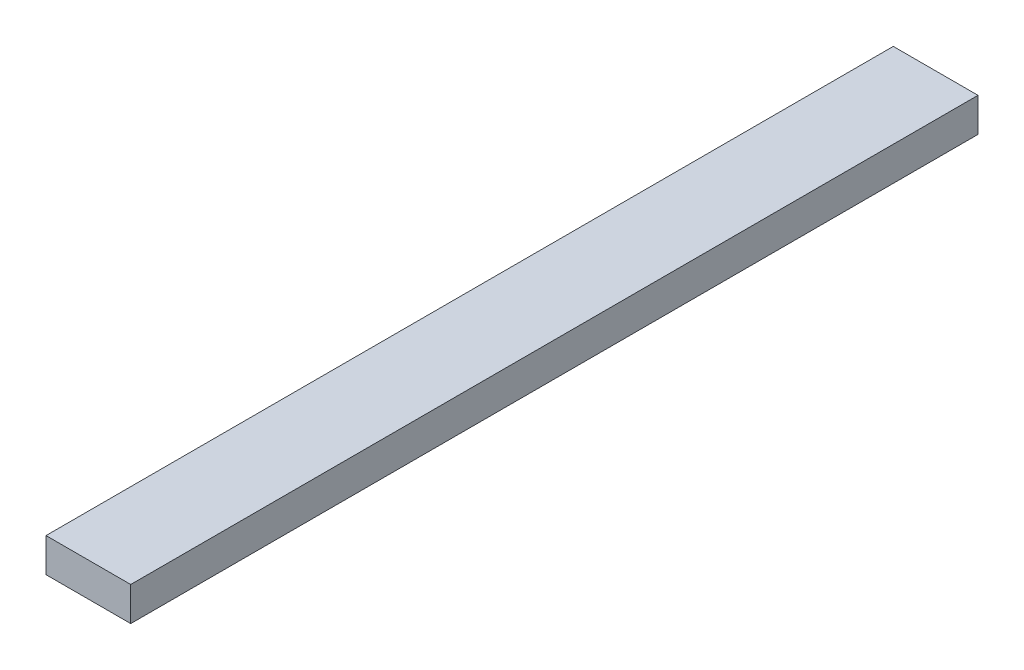
ISO-10303-21;
HEADER;
FILE_DESCRIPTION(('STEP AP214'),'2;1');
FILE_NAME('part.step','',(''),(''),'','','');
FILE_SCHEMA(('AUTOMOTIVE_DESIGN { 1 0 10303 214 1 1 1 1 }'));
ENDSEC;
DATA;
#1=APPLICATION_CONTEXT('core data for automotive mechanical design processes');
#2=APPLICATION_PROTOCOL_DEFINITION('international standard','automotive_design',2000,#1);
#3=PRODUCT_CONTEXT('',#1,'mechanical');
#4=PRODUCT('Part','Part','',(#3));
#5=PRODUCT_RELATED_PRODUCT_CATEGORY('part','',(#4));
#6=PRODUCT_DEFINITION_FORMATION('','',#4);
#7=PRODUCT_DEFINITION_CONTEXT('part definition',#1,'design');
#8=PRODUCT_DEFINITION('design','',#6,#7);
#9=PRODUCT_DEFINITION_SHAPE('','',#8);
#10=(LENGTH_UNIT() NAMED_UNIT(*) SI_UNIT(.MILLI.,.METRE.));
#11=(NAMED_UNIT(*) PLANE_ANGLE_UNIT() SI_UNIT($,.RADIAN.));
#12=(NAMED_UNIT(*) SI_UNIT($,.STERADIAN.) SOLID_ANGLE_UNIT());
#13=UNCERTAINTY_MEASURE_WITH_UNIT(LENGTH_MEASURE(1.E-05),#10,'distance_accuracy_value','');
#14=(GEOMETRIC_REPRESENTATION_CONTEXT(3) GLOBAL_UNCERTAINTY_ASSIGNED_CONTEXT((#13)) GLOBAL_UNIT_ASSIGNED_CONTEXT((#10,
#11,#12)) REPRESENTATION_CONTEXT('',''));
#15=CARTESIAN_POINT('',(0.,0.,0.));
#16=DIRECTION('',(0.,0.,1.));
#17=DIRECTION('',(1.,0.,0.));
#18=AXIS2_PLACEMENT_3D('',#15,#16,#17);
#19=CARTESIAN_POINT('',(25.,10.,500.));
#20=DIRECTION('',(-1.,0.,0.));
#21=DIRECTION('',(0.,0.,1.));
#22=AXIS2_PLACEMENT_3D('',#19,#20,#21);
#23=PLANE('',#22);
#24=DIRECTION('',(0.,1.,0.));
#25=VECTOR('',#24,1.);
#26=CARTESIAN_POINT('',(25.,10.,0.));
#27=LINE('',#26,#25);
#28=CARTESIAN_POINT('',(25.,-10.,0.));
#29=VERTEX_POINT('',#28);
#30=CARTESIAN_POINT('',(25.,10.,0.));
#31=VERTEX_POINT('',#30);
#32=EDGE_CURVE('E104',#29,#31,#27,.T.);
#33=ORIENTED_EDGE('',*,*,#32,.T.);
#34=DIRECTION('',(0.,0.,-1.));
#35=VECTOR('',#34,1.);
#36=CARTESIAN_POINT('',(25.,10.,500.));
#37=LINE('',#36,#35);
#38=CARTESIAN_POINT('',(25.,10.,500.));
#39=VERTEX_POINT('',#38);
#40=EDGE_CURVE('E11',#39,#31,#37,.T.);
#41=ORIENTED_EDGE('',*,*,#40,.F.);
#42=DIRECTION('',(0.,1.,0.));
#43=VECTOR('',#42,1.);
#44=CARTESIAN_POINT('',(25.,10.,500.));
#45=LINE('',#44,#43);
#46=CARTESIAN_POINT('',(25.,-10.,500.));
#47=VERTEX_POINT('',#46);
#48=EDGE_CURVE('E92',#47,#39,#45,.T.);
#49=ORIENTED_EDGE('',*,*,#48,.F.);
#50=DIRECTION('',(0.,0.,-1.));
#51=VECTOR('',#50,1.);
#52=CARTESIAN_POINT('',(25.,-10.,500.));
#53=LINE('',#52,#51);
#54=EDGE_CURVE('E100',#47,#29,#53,.T.);
#55=ORIENTED_EDGE('',*,*,#54,.T.);
#56=EDGE_LOOP('',(#33,#41,#49,#55));
#57=FACE_BOUND('',#56,.T.);
#58=ADVANCED_FACE('F41',(#57),#23,.F.);
#59=CARTESIAN_POINT('',(-25.,10.,500.));
#60=DIRECTION('',(0.,-1.,0.));
#61=DIRECTION('',(0.,0.,-1.));
#62=AXIS2_PLACEMENT_3D('',#59,#60,#61);
#63=PLANE('',#62);
#64=DIRECTION('',(-1.,0.,0.));
#65=VECTOR('',#64,1.);
#66=CARTESIAN_POINT('',(-25.,10.,0.));
#67=LINE('',#66,#65);
#68=CARTESIAN_POINT('',(-25.,10.,0.));
#69=VERTEX_POINT('',#68);
#70=EDGE_CURVE('E96',#31,#69,#67,.T.);
#71=ORIENTED_EDGE('',*,*,#70,.T.);
#72=DIRECTION('',(0.,0.,-1.));
#73=VECTOR('',#72,1.);
#74=CARTESIAN_POINT('',(-25.,10.,500.));
#75=LINE('',#74,#73);
#76=CARTESIAN_POINT('',(-25.,10.,500.));
#77=VERTEX_POINT('',#76);
#78=EDGE_CURVE('E49',#77,#69,#75,.T.);
#79=ORIENTED_EDGE('',*,*,#78,.F.);
#80=DIRECTION('',(-1.,0.,0.));
#81=VECTOR('',#80,1.);
#82=CARTESIAN_POINT('',(-25.,10.,500.));
#83=LINE('',#82,#81);
#84=EDGE_CURVE('E87',#39,#77,#83,.T.);
#85=ORIENTED_EDGE('',*,*,#84,.F.);
#86=ORIENTED_EDGE('',*,*,#40,.T.);
#87=EDGE_LOOP('',(#71,#79,#85,#86));
#88=FACE_BOUND('',#87,.T.);
#89=ADVANCED_FACE('F95',(#88),#63,.F.);
#90=CARTESIAN_POINT('',(-25.,10.,500.));
#91=DIRECTION('',(1.,0.,0.));
#92=DIRECTION('',(0.,1.,0.));
#93=AXIS2_PLACEMENT_3D('',#90,#91,#92);
#94=PLANE('',#93);
#95=DIRECTION('',(0.,-1.,0.));
#96=VECTOR('',#95,1.);
#97=CARTESIAN_POINT('',(-25.,10.,0.));
#98=LINE('',#97,#96);
#99=CARTESIAN_POINT('',(-25.,-10.,0.));
#100=VERTEX_POINT('',#99);
#101=EDGE_CURVE('E74',#69,#100,#98,.T.);
#102=ORIENTED_EDGE('',*,*,#101,.T.);
#103=DIRECTION('',(0.,0.,-1.));
#104=VECTOR('',#103,1.);
#105=CARTESIAN_POINT('',(-25.,-10.,500.));
#106=LINE('',#105,#104);
#107=CARTESIAN_POINT('',(-25.,-10.,500.));
#108=VERTEX_POINT('',#107);
#109=EDGE_CURVE('E97',#108,#100,#106,.T.);
#110=ORIENTED_EDGE('',*,*,#109,.F.);
#111=DIRECTION('',(0.,-1.,0.));
#112=VECTOR('',#111,1.);
#113=CARTESIAN_POINT('',(-25.,10.,500.));
#114=LINE('',#113,#112);
#115=EDGE_CURVE('E90',#77,#108,#114,.T.);
#116=ORIENTED_EDGE('',*,*,#115,.F.);
#117=ORIENTED_EDGE('',*,*,#78,.T.);
#118=EDGE_LOOP('',(#102,#110,#116,#117));
#119=FACE_BOUND('',#118,.T.);
#120=ADVANCED_FACE('F98',(#119),#94,.F.);
#121=CARTESIAN_POINT('',(-25.,-10.,500.));
#122=DIRECTION('',(0.,1.,0.));
#123=DIRECTION('',(0.,0.,1.));
#124=AXIS2_PLACEMENT_3D('',#121,#122,#123);
#125=PLANE('',#124);
#126=DIRECTION('',(1.,0.,0.));
#127=VECTOR('',#126,1.);
#128=CARTESIAN_POINT('',(-25.,-10.,0.));
#129=LINE('',#128,#127);
#130=EDGE_CURVE('E80',#100,#29,#129,.T.);
#131=ORIENTED_EDGE('',*,*,#130,.T.);
#132=ORIENTED_EDGE('',*,*,#54,.F.);
#133=DIRECTION('',(1.,0.,0.));
#134=VECTOR('',#133,1.);
#135=CARTESIAN_POINT('',(-25.,-10.,500.));
#136=LINE('',#135,#134);
#137=EDGE_CURVE('E57',#108,#47,#136,.T.);
#138=ORIENTED_EDGE('',*,*,#137,.F.);
#139=ORIENTED_EDGE('',*,*,#109,.T.);
#140=EDGE_LOOP('',(#131,#132,#138,#139));
#141=FACE_BOUND('',#140,.T.);
#142=ADVANCED_FACE('F111',(#141),#125,.F.);
#143=CARTESIAN_POINT('',(0.,0.,500.));
#144=DIRECTION('',(0.,0.,1.));
#145=DIRECTION('',(1.,0.,0.));
#146=AXIS2_PLACEMENT_3D('',#143,#144,#145);
#147=PLANE('',#146);
#148=ORIENTED_EDGE('',*,*,#48,.T.);
#149=ORIENTED_EDGE('',*,*,#84,.T.);
#150=ORIENTED_EDGE('',*,*,#115,.T.);
#151=ORIENTED_EDGE('',*,*,#137,.T.);
#152=EDGE_LOOP('',(#148,#149,#150,#151));
#153=FACE_BOUND('',#152,.T.);
#154=ADVANCED_FACE('F88',(#153),#147,.T.);
#155=CARTESIAN_POINT('',(0.,0.,0.));
#156=DIRECTION('',(0.,0.,1.));
#157=DIRECTION('',(1.,0.,0.));
#158=AXIS2_PLACEMENT_3D('',#155,#156,#157);
#159=PLANE('',#158);
#160=ORIENTED_EDGE('',*,*,#32,.F.);
#161=ORIENTED_EDGE('',*,*,#130,.F.);
#162=ORIENTED_EDGE('',*,*,#101,.F.);
#163=ORIENTED_EDGE('',*,*,#70,.F.);
#164=EDGE_LOOP('',(#160,#161,#162,#163));
#165=FACE_BOUND('',#164,.T.);
#166=ADVANCED_FACE('F114',(#165),#159,.F.);
#167=CLOSED_SHELL('',(#58,#89,#120,#142,#154,#166));
#168=MANIFOLD_SOLID_BREP('B2',#167);
#169=ADVANCED_BREP_SHAPE_REPRESENTATION('',(#18,#168),#14);
#170=SHAPE_DEFINITION_REPRESENTATION(#9,#169);
ENDSEC;
END-ISO-10303-21;
